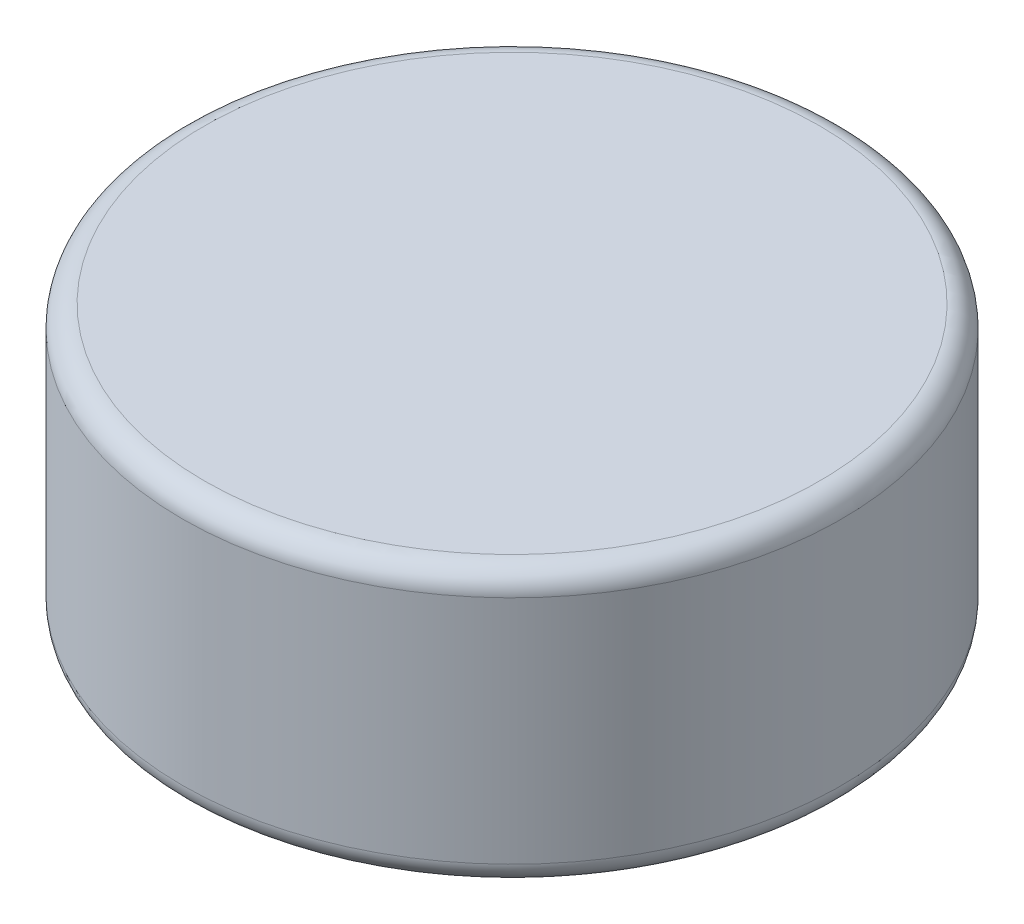
ISO-10303-21;
HEADER;
FILE_DESCRIPTION(('STEP AP214'),'2;1');
FILE_NAME('part.step','',(''),(''),'','','');
FILE_SCHEMA(('AUTOMOTIVE_DESIGN { 1 0 10303 214 1 1 1 1 }'));
ENDSEC;
DATA;
#1=APPLICATION_CONTEXT('core data for automotive mechanical design processes');
#2=APPLICATION_PROTOCOL_DEFINITION('international standard','automotive_design',2000,#1);
#3=PRODUCT_CONTEXT('',#1,'mechanical');
#4=PRODUCT('Part','Part','',(#3));
#5=PRODUCT_RELATED_PRODUCT_CATEGORY('part','',(#4));
#6=PRODUCT_DEFINITION_FORMATION('','',#4);
#7=PRODUCT_DEFINITION_CONTEXT('part definition',#1,'design');
#8=PRODUCT_DEFINITION('design','',#6,#7);
#9=PRODUCT_DEFINITION_SHAPE('','',#8);
#10=(LENGTH_UNIT() NAMED_UNIT(*) SI_UNIT(.MILLI.,.METRE.));
#11=(NAMED_UNIT(*) PLANE_ANGLE_UNIT() SI_UNIT($,.RADIAN.));
#12=(NAMED_UNIT(*) SI_UNIT($,.STERADIAN.) SOLID_ANGLE_UNIT());
#13=UNCERTAINTY_MEASURE_WITH_UNIT(LENGTH_MEASURE(1.E-05),#10,'distance_accuracy_value','');
#14=(GEOMETRIC_REPRESENTATION_CONTEXT(3) GLOBAL_UNCERTAINTY_ASSIGNED_CONTEXT((#13)) GLOBAL_UNIT_ASSIGNED_CONTEXT((#10,
#11,#12)) REPRESENTATION_CONTEXT('',''));
#15=CARTESIAN_POINT('',(0.,0.,0.));
#16=DIRECTION('',(0.,0.,1.));
#17=DIRECTION('',(1.,0.,0.));
#18=AXIS2_PLACEMENT_3D('',#15,#16,#17);
#19=CARTESIAN_POINT('',(0.,1.25,0.));
#20=DIRECTION('',(0.,-1.,0.));
#21=DIRECTION('',(0.,0.,-1.));
#22=AXIS2_PLACEMENT_3D('',#19,#20,#21);
#23=CYLINDRICAL_SURFACE('',#22,3.);
#24=CARTESIAN_POINT('',(0.,-1.05,0.));
#25=DIRECTION('',(0.,1.,0.));
#26=DIRECTION('',(0.,0.,1.));
#27=AXIS2_PLACEMENT_3D('',#24,#25,#26);
#28=CIRCLE('',#27,3.);
#29=CARTESIAN_POINT('',(0.,-1.05,3.));
#30=VERTEX_POINT('',#29);
#31=EDGE_CURVE('E42',#30,#30,#28,.T.);
#32=ORIENTED_EDGE('',*,*,#31,.T.);
#33=EDGE_LOOP('',(#32));
#34=FACE_BOUND('',#33,.T.);
#35=CARTESIAN_POINT('',(0.,1.05,0.));
#36=DIRECTION('',(0.,1.,0.));
#37=DIRECTION('',(0.,0.,1.));
#38=AXIS2_PLACEMENT_3D('',#35,#36,#37);
#39=CIRCLE('',#38,3.);
#40=CARTESIAN_POINT('',(0.,1.05,3.));
#41=VERTEX_POINT('',#40);
#42=EDGE_CURVE('E46',#41,#41,#39,.F.);
#43=ORIENTED_EDGE('',*,*,#42,.T.);
#44=EDGE_LOOP('',(#43));
#45=FACE_BOUND('',#44,.T.);
#46=ADVANCED_FACE('F31',(#34,#45),#23,.T.);
#47=CARTESIAN_POINT('',(0.,1.25,0.));
#48=DIRECTION('',(0.,1.,0.));
#49=DIRECTION('',(0.,0.,1.));
#50=AXIS2_PLACEMENT_3D('',#47,#48,#49);
#51=PLANE('',#50);
#52=CARTESIAN_POINT('',(0.,1.25,0.));
#53=DIRECTION('',(0.,1.,0.));
#54=DIRECTION('',(0.,0.,1.));
#55=AXIS2_PLACEMENT_3D('',#52,#53,#54);
#56=CIRCLE('',#55,2.8);
#57=CARTESIAN_POINT('',(0.,1.25,2.8));
#58=VERTEX_POINT('',#57);
#59=EDGE_CURVE('E10',#58,#58,#56,.T.);
#60=ORIENTED_EDGE('',*,*,#59,.T.);
#61=EDGE_LOOP('',(#60));
#62=FACE_BOUND('',#61,.T.);
#63=ADVANCED_FACE('F62',(#62),#51,.T.);
#64=CARTESIAN_POINT('',(0.,-1.25,0.));
#65=DIRECTION('',(0.,1.,0.));
#66=DIRECTION('',(0.,0.,1.));
#67=AXIS2_PLACEMENT_3D('',#64,#65,#66);
#68=PLANE('',#67);
#69=CARTESIAN_POINT('',(0.,-1.25,0.));
#70=DIRECTION('',(0.,1.,0.));
#71=DIRECTION('',(0.,0.,1.));
#72=AXIS2_PLACEMENT_3D('',#69,#70,#71);
#73=CIRCLE('',#72,2.8);
#74=CARTESIAN_POINT('',(0.,-1.25,2.8));
#75=VERTEX_POINT('',#74);
#76=EDGE_CURVE('E38',#75,#75,#73,.F.);
#77=ORIENTED_EDGE('',*,*,#76,.T.);
#78=EDGE_LOOP('',(#77));
#79=FACE_BOUND('',#78,.T.);
#80=ADVANCED_FACE('F59',(#79),#68,.F.);
#81=CARTESIAN_POINT('',(0.,-1.05,0.));
#82=DIRECTION('',(0.,1.,0.));
#83=DIRECTION('',(0.,0.,1.));
#84=AXIS2_PLACEMENT_3D('',#81,#82,#83);
#85=TOROIDAL_SURFACE('',#84,2.8,0.2);
#86=ORIENTED_EDGE('',*,*,#76,.F.);
#87=EDGE_LOOP('',(#86));
#88=FACE_BOUND('',#87,.T.);
#89=ORIENTED_EDGE('',*,*,#31,.F.);
#90=EDGE_LOOP('',(#89));
#91=FACE_BOUND('',#90,.T.);
#92=ADVANCED_FACE('F55',(#88,#91),#85,.T.);
#93=CARTESIAN_POINT('',(0.,1.05,0.));
#94=DIRECTION('',(0.,1.,0.));
#95=DIRECTION('',(0.,0.,1.));
#96=AXIS2_PLACEMENT_3D('',#93,#94,#95);
#97=TOROIDAL_SURFACE('',#96,2.8,0.2);
#98=ORIENTED_EDGE('',*,*,#42,.F.);
#99=EDGE_LOOP('',(#98));
#100=FACE_BOUND('',#99,.T.);
#101=ORIENTED_EDGE('',*,*,#59,.F.);
#102=EDGE_LOOP('',(#101));
#103=FACE_BOUND('',#102,.T.);
#104=ADVANCED_FACE('F33',(#100,#103),#97,.T.);
#105=CLOSED_SHELL('',(#46,#63,#80,#92,#104));
#106=MANIFOLD_SOLID_BREP('B2',#105);
#107=ADVANCED_BREP_SHAPE_REPRESENTATION('',(#18,#106),#14);
#108=SHAPE_DEFINITION_REPRESENTATION(#9,#107);
ENDSEC;
END-ISO-10303-21;
